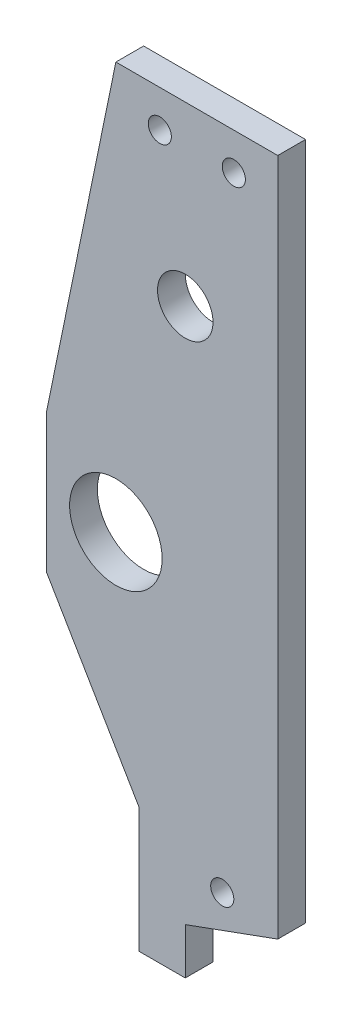
ISO-10303-21;
HEADER;
FILE_DESCRIPTION(('STEP AP214'),'2;1');
FILE_NAME('part.step','',(''),(''),'','','');
FILE_SCHEMA(('AUTOMOTIVE_DESIGN { 1 0 10303 214 1 1 1 1 }'));
ENDSEC;
DATA;
#1=APPLICATION_CONTEXT('core data for automotive mechanical design processes');
#2=APPLICATION_PROTOCOL_DEFINITION('international standard','automotive_design',2000,#1);
#3=PRODUCT_CONTEXT('',#1,'mechanical');
#4=PRODUCT('Part','Part','',(#3));
#5=PRODUCT_RELATED_PRODUCT_CATEGORY('part','',(#4));
#6=PRODUCT_DEFINITION_FORMATION('','',#4);
#7=PRODUCT_DEFINITION_CONTEXT('part definition',#1,'design');
#8=PRODUCT_DEFINITION('design','',#6,#7);
#9=PRODUCT_DEFINITION_SHAPE('','',#8);
#10=(LENGTH_UNIT() NAMED_UNIT(*) SI_UNIT(.MILLI.,.METRE.));
#11=(NAMED_UNIT(*) PLANE_ANGLE_UNIT() SI_UNIT($,.RADIAN.));
#12=(NAMED_UNIT(*) SI_UNIT($,.STERADIAN.) SOLID_ANGLE_UNIT());
#13=UNCERTAINTY_MEASURE_WITH_UNIT(LENGTH_MEASURE(1.E-05),#10,'distance_accuracy_value','');
#14=(GEOMETRIC_REPRESENTATION_CONTEXT(3) GLOBAL_UNCERTAINTY_ASSIGNED_CONTEXT((#13)) GLOBAL_UNIT_ASSIGNED_CONTEXT((#10,
#11,#12)) REPRESENTATION_CONTEXT('',''));
#15=CARTESIAN_POINT('',(0.,0.,0.));
#16=DIRECTION('',(0.,0.,1.));
#17=DIRECTION('',(1.,0.,0.));
#18=AXIS2_PLACEMENT_3D('',#15,#16,#17);
#19=CARTESIAN_POINT('',(-71.0247504159733,-1.68032445923463,0.));
#20=DIRECTION('',(-0.86193421515777,-0.507020126563394,0.));
#21=DIRECTION('',(0.507020126563394,-0.861934215157769,0.));
#22=AXIS2_PLACEMENT_3D('',#19,#20,#21);
#23=PLANE('',#22);
#24=DIRECTION('',(0.507020126563394,-0.861934215157769,0.));
#25=VECTOR('',#24,1.);
#26=CARTESIAN_POINT('',(-71.0247504159733,-1.68032445923463,0.));
#27=LINE('',#26,#25);
#28=CARTESIAN_POINT('',(-71.0247504159733,-1.68032445923463,0.));
#29=VERTEX_POINT('',#28);
#30=CARTESIAN_POINT('',(-61.0247504159733,-18.6803244592347,0.));
#31=VERTEX_POINT('',#30);
#32=EDGE_CURVE('E141',#29,#31,#27,.T.);
#33=ORIENTED_EDGE('',*,*,#32,.T.);
#34=DIRECTION('',(0.,0.,1.));
#35=VECTOR('',#34,1.);
#36=CARTESIAN_POINT('',(-61.0247504159733,-18.6803244592347,0.));
#37=LINE('',#36,#35);
#38=CARTESIAN_POINT('',(-61.0247504159733,-18.6803244592347,3.));
#39=VERTEX_POINT('',#38);
#40=EDGE_CURVE('E173',#31,#39,#37,.T.);
#41=ORIENTED_EDGE('',*,*,#40,.T.);
#42=DIRECTION('',(0.507020126563394,-0.861934215157769,0.));
#43=VECTOR('',#42,1.);
#44=CARTESIAN_POINT('',(-71.0247504159733,-1.68032445923463,3.));
#45=LINE('',#44,#43);
#46=CARTESIAN_POINT('',(-71.0247504159733,-1.68032445923463,3.));
#47=VERTEX_POINT('',#46);
#48=EDGE_CURVE('E59',#47,#39,#45,.T.);
#49=ORIENTED_EDGE('',*,*,#48,.F.);
#50=DIRECTION('',(0.,0.,1.));
#51=VECTOR('',#50,1.);
#52=CARTESIAN_POINT('',(-71.0247504159733,-1.68032445923463,0.));
#53=LINE('',#52,#51);
#54=EDGE_CURVE('E133',#29,#47,#53,.T.);
#55=ORIENTED_EDGE('',*,*,#54,.F.);
#56=EDGE_LOOP('',(#33,#41,#49,#55));
#57=FACE_BOUND('',#56,.T.);
#58=ADVANCED_FACE('F35',(#57),#23,.T.);
#59=CARTESIAN_POINT('',(-56.0247504159734,49.8196755407654,3.));
#60=DIRECTION('',(0.,-1.,0.));
#61=DIRECTION('',(0.,0.,-1.));
#62=AXIS2_PLACEMENT_3D('',#59,#60,#61);
#63=PLANE('',#62);
#64=DIRECTION('',(-1.,0.,0.));
#65=VECTOR('',#64,1.);
#66=CARTESIAN_POINT('',(-56.0247504159734,49.8196755407654,3.));
#67=LINE('',#66,#65);
#68=CARTESIAN_POINT('',(-46.0247504159733,49.8196755407654,3.));
#69=VERTEX_POINT('',#68);
#70=CARTESIAN_POINT('',(-63.5247504159734,49.8196755407654,3.));
#71=VERTEX_POINT('',#70);
#72=EDGE_CURVE('E123',#69,#71,#67,.T.);
#73=ORIENTED_EDGE('',*,*,#72,.F.);
#74=DIRECTION('',(0.,0.,1.));
#75=VECTOR('',#74,1.);
#76=CARTESIAN_POINT('',(-46.0247504159733,49.8196755407654,-5.00000000001367E-05));
#77=LINE('',#76,#75);
#78=CARTESIAN_POINT('',(-46.0247504159733,49.8196755407654,0.));
#79=VERTEX_POINT('',#78);
#80=EDGE_CURVE('E107',#79,#69,#77,.T.);
#81=ORIENTED_EDGE('',*,*,#80,.F.);
#82=DIRECTION('',(-1.,0.,0.));
#83=VECTOR('',#82,1.);
#84=CARTESIAN_POINT('',(-56.0247504159734,49.8196755407654,0.));
#85=LINE('',#84,#83);
#86=CARTESIAN_POINT('',(-63.5247504159734,49.8196755407654,0.));
#87=VERTEX_POINT('',#86);
#88=EDGE_CURVE('E130',#79,#87,#85,.T.);
#89=ORIENTED_EDGE('',*,*,#88,.T.);
#90=DIRECTION('',(0.,0.,1.));
#91=VECTOR('',#90,1.);
#92=CARTESIAN_POINT('',(-63.5247504159734,49.8196755407654,0.));
#93=LINE('',#92,#91);
#94=EDGE_CURVE('E128',#87,#71,#93,.T.);
#95=ORIENTED_EDGE('',*,*,#94,.T.);
#96=EDGE_LOOP('',(#73,#81,#89,#95));
#97=FACE_BOUND('',#96,.T.);
#98=ADVANCED_FACE('F37',(#97),#63,.F.);
#99=CARTESIAN_POINT('',(0.,0.,3.));
#100=DIRECTION('',(0.,0.,-1.));
#101=DIRECTION('',(-1.,0.,0.));
#102=AXIS2_PLACEMENT_3D('',#99,#100,#101);
#103=PLANE('',#102);
#104=CARTESIAN_POINT('',(-50.7747504159733,45.8196755407654,3.));
#105=DIRECTION('',(0.,0.,1.));
#106=DIRECTION('',(1.,0.,0.));
#107=AXIS2_PLACEMENT_3D('',#104,#105,#106);
#108=CIRCLE('',#107,1.25);
#109=CARTESIAN_POINT('',(-49.5247504159733,45.8196755407654,3.));
#110=VERTEX_POINT('',#109);
#111=EDGE_CURVE('E273',#110,#110,#108,.T.);
#112=ORIENTED_EDGE('',*,*,#111,.F.);
#113=EDGE_LOOP('',(#112));
#114=FACE_BOUND('',#113,.T.);
#115=CARTESIAN_POINT('',(-58.7747504159734,45.8196755407654,3.));
#116=DIRECTION('',(0.,0.,1.));
#117=DIRECTION('',(1.,0.,0.));
#118=AXIS2_PLACEMENT_3D('',#115,#116,#117);
#119=CIRCLE('',#118,1.25);
#120=CARTESIAN_POINT('',(-57.5247504159734,45.8196755407654,3.));
#121=VERTEX_POINT('',#120);
#122=EDGE_CURVE('E265',#121,#121,#119,.T.);
#123=ORIENTED_EDGE('',*,*,#122,.F.);
#124=EDGE_LOOP('',(#123));
#125=FACE_BOUND('',#124,.T.);
#126=CARTESIAN_POINT('',(-52.0247504159733,-22.1803244592346,3.));
#127=DIRECTION('',(0.,0.,1.));
#128=DIRECTION('',(1.,0.,0.));
#129=AXIS2_PLACEMENT_3D('',#126,#127,#128);
#130=CIRCLE('',#129,1.25);
#131=CARTESIAN_POINT('',(-50.7747504159733,-22.1803244592346,3.));
#132=VERTEX_POINT('',#131);
#133=EDGE_CURVE('E195',#132,#132,#130,.T.);
#134=ORIENTED_EDGE('',*,*,#133,.F.);
#135=EDGE_LOOP('',(#134));
#136=FACE_BOUND('',#135,.T.);
#137=CARTESIAN_POINT('',(-56.0247504159733,30.7144541097746,3.));
#138=DIRECTION('',(0.,0.,1.));
#139=DIRECTION('',(1.,0.,0.));
#140=AXIS2_PLACEMENT_3D('',#137,#138,#139);
#141=CIRCLE('',#140,3.);
#142=CARTESIAN_POINT('',(-53.0247504159733,30.7144541097746,3.));
#143=VERTEX_POINT('',#142);
#144=EDGE_CURVE('E192',#143,#143,#141,.T.);
#145=ORIENTED_EDGE('',*,*,#144,.F.);
#146=EDGE_LOOP('',(#145));
#147=FACE_BOUND('',#146,.T.);
#148=CARTESIAN_POINT('',(-63.5247504159734,5.81967554076537,3.));
#149=DIRECTION('',(0.,0.,1.));
#150=DIRECTION('',(1.,0.,0.));
#151=AXIS2_PLACEMENT_3D('',#148,#149,#150);
#152=CIRCLE('',#151,5.);
#153=CARTESIAN_POINT('',(-58.5247504159734,5.81967554076537,3.));
#154=VERTEX_POINT('',#153);
#155=EDGE_CURVE('E188',#154,#154,#152,.T.);
#156=ORIENTED_EDGE('',*,*,#155,.F.);
#157=EDGE_LOOP('',(#156));
#158=FACE_BOUND('',#157,.T.);
#159=DIRECTION('',(0.,1.,0.));
#160=VECTOR('',#159,1.);
#161=CARTESIAN_POINT('',(-56.0247504159734,-27.1803244592346,3.));
#162=LINE('',#161,#160);
#163=CARTESIAN_POINT('',(-56.0247504159733,-32.1803244592346,3.));
#164=VERTEX_POINT('',#163);
#165=CARTESIAN_POINT('',(-56.0247504159734,-27.1803244592346,3.));
#166=VERTEX_POINT('',#165);
#167=EDGE_CURVE('E182',#164,#166,#162,.T.);
#168=ORIENTED_EDGE('',*,*,#167,.T.);
#169=DIRECTION('',(-0.939692620785908,-0.342020143325669,0.));
#170=VECTOR('',#169,1.);
#171=CARTESIAN_POINT('',(-56.0247504159734,-27.1803244592346,3.));
#172=LINE('',#171,#170);
#173=CARTESIAN_POINT('',(-46.0247504159733,-23.5406221165726,3.));
#174=VERTEX_POINT('',#173);
#175=EDGE_CURVE('E118',#174,#166,#172,.T.);
#176=ORIENTED_EDGE('',*,*,#175,.F.);
#177=DIRECTION('',(0.,-1.,0.));
#178=VECTOR('',#177,1.);
#179=CARTESIAN_POINT('',(-46.0247504159733,49.8196755407654,3.));
#180=LINE('',#179,#178);
#181=EDGE_CURVE('E111',#69,#174,#180,.T.);
#182=ORIENTED_EDGE('',*,*,#181,.F.);
#183=ORIENTED_EDGE('',*,*,#72,.T.);
#184=DIRECTION('',(-0.201274298349514,-0.979534918634303,0.));
#185=VECTOR('',#184,1.);
#186=CARTESIAN_POINT('',(-71.0247504159733,13.3196755407654,3.));
#187=LINE('',#186,#185);
#188=CARTESIAN_POINT('',(-71.0247504159733,13.3196755407654,3.));
#189=VERTEX_POINT('',#188);
#190=EDGE_CURVE('E159',#71,#189,#187,.T.);
#191=ORIENTED_EDGE('',*,*,#190,.T.);
#192=DIRECTION('',(0.,-1.,0.));
#193=VECTOR('',#192,1.);
#194=CARTESIAN_POINT('',(-71.0247504159733,-1.68032445923463,3.));
#195=LINE('',#194,#193);
#196=EDGE_CURVE('E151',#189,#47,#195,.T.);
#197=ORIENTED_EDGE('',*,*,#196,.T.);
#198=ORIENTED_EDGE('',*,*,#48,.T.);
#199=DIRECTION('',(0.,-1.,0.));
#200=VECTOR('',#199,1.);
#201=CARTESIAN_POINT('',(-61.0247504159733,-32.1803244592346,3.));
#202=LINE('',#201,#200);
#203=CARTESIAN_POINT('',(-61.0247504159733,-32.1803244592346,3.));
#204=VERTEX_POINT('',#203);
#205=EDGE_CURVE('E52',#39,#204,#202,.T.);
#206=ORIENTED_EDGE('',*,*,#205,.T.);
#207=DIRECTION('',(1.,0.,0.));
#208=VECTOR('',#207,1.);
#209=CARTESIAN_POINT('',(-56.0247504159733,-32.1803244592346,3.));
#210=LINE('',#209,#208);
#211=EDGE_CURVE('E212',#204,#164,#210,.T.);
#212=ORIENTED_EDGE('',*,*,#211,.T.);
#213=EDGE_LOOP('',(#168,#176,#182,#183,#191,#197,#198,#206,#212));
#214=FACE_BOUND('',#213,.T.);
#215=ADVANCED_FACE('F122',(#114,#125,#136,#147,#158,#214),#103,.F.);
#216=CARTESIAN_POINT('',(0.,0.,0.));
#217=DIRECTION('',(0.,0.,-1.));
#218=DIRECTION('',(-1.,0.,0.));
#219=AXIS2_PLACEMENT_3D('',#216,#217,#218);
#220=PLANE('',#219);
#221=CARTESIAN_POINT('',(-50.7747504159733,45.8196755407654,0.));
#222=DIRECTION('',(0.,0.,-1.));
#223=DIRECTION('',(-1.,0.,0.));
#224=AXIS2_PLACEMENT_3D('',#221,#222,#223);
#225=CIRCLE('',#224,1.25);
#226=CARTESIAN_POINT('',(-52.0247504159734,45.8196755407654,0.));
#227=VERTEX_POINT('',#226);
#228=EDGE_CURVE('E39',#227,#227,#225,.T.);
#229=ORIENTED_EDGE('',*,*,#228,.F.);
#230=EDGE_LOOP('',(#229));
#231=FACE_BOUND('',#230,.T.);
#232=CARTESIAN_POINT('',(-58.7747504159734,45.8196755407654,0.));
#233=DIRECTION('',(0.,0.,-1.));
#234=DIRECTION('',(-1.,0.,0.));
#235=AXIS2_PLACEMENT_3D('',#232,#233,#234);
#236=CIRCLE('',#235,1.25);
#237=CARTESIAN_POINT('',(-60.0247504159734,45.8196755407654,0.));
#238=VERTEX_POINT('',#237);
#239=EDGE_CURVE('E125',#238,#238,#236,.T.);
#240=ORIENTED_EDGE('',*,*,#239,.F.);
#241=EDGE_LOOP('',(#240));
#242=FACE_BOUND('',#241,.T.);
#243=DIRECTION('',(0.939692620785908,0.342020143325669,0.));
#244=VECTOR('',#243,1.);
#245=CARTESIAN_POINT('',(2.18193705348334,-5.99482278511683,0.));
#246=LINE('',#245,#244);
#247=CARTESIAN_POINT('',(-56.0247504159734,-27.1803244592346,-2.5E-06));
#248=VERTEX_POINT('',#247);
#249=CARTESIAN_POINT('',(-46.0247504159733,-23.5406221165726,0.));
#250=VERTEX_POINT('',#249);
#251=EDGE_CURVE('E201',#248,#250,#246,.T.);
#252=ORIENTED_EDGE('',*,*,#251,.F.);
#253=DIRECTION('',(0.,1.,0.));
#254=VECTOR('',#253,1.);
#255=CARTESIAN_POINT('',(-56.0247504159734,-27.1803244592346,0.));
#256=LINE('',#255,#254);
#257=CARTESIAN_POINT('',(-56.0247504159733,-32.1803244592346,0.));
#258=VERTEX_POINT('',#257);
#259=EDGE_CURVE('E176',#258,#248,#256,.T.);
#260=ORIENTED_EDGE('',*,*,#259,.F.);
#261=DIRECTION('',(1.,0.,0.));
#262=VECTOR('',#261,1.);
#263=CARTESIAN_POINT('',(-56.0247504159733,-32.1803244592346,0.));
#264=LINE('',#263,#262);
#265=CARTESIAN_POINT('',(-61.0247504159733,-32.1803244592346,0.));
#266=VERTEX_POINT('',#265);
#267=EDGE_CURVE('E181',#266,#258,#264,.T.);
#268=ORIENTED_EDGE('',*,*,#267,.F.);
#269=DIRECTION('',(0.,-1.,0.));
#270=VECTOR('',#269,1.);
#271=CARTESIAN_POINT('',(-61.0247504159733,-32.1803244592346,0.));
#272=LINE('',#271,#270);
#273=EDGE_CURVE('E178',#31,#266,#272,.T.);
#274=ORIENTED_EDGE('',*,*,#273,.F.);
#275=ORIENTED_EDGE('',*,*,#32,.F.);
#276=DIRECTION('',(0.,-1.,0.));
#277=VECTOR('',#276,1.);
#278=CARTESIAN_POINT('',(-71.0247504159733,-1.68032445923463,0.));
#279=LINE('',#278,#277);
#280=CARTESIAN_POINT('',(-71.0247504159733,13.3196755407654,0.));
#281=VERTEX_POINT('',#280);
#282=EDGE_CURVE('E148',#281,#29,#279,.T.);
#283=ORIENTED_EDGE('',*,*,#282,.F.);
#284=DIRECTION('',(-0.201274298349514,-0.979534918634303,0.));
#285=VECTOR('',#284,1.);
#286=CARTESIAN_POINT('',(-71.0247504159733,13.3196755407654,0.));
#287=LINE('',#286,#285);
#288=EDGE_CURVE('E161',#87,#281,#287,.T.);
#289=ORIENTED_EDGE('',*,*,#288,.F.);
#290=ORIENTED_EDGE('',*,*,#88,.F.);
#291=DIRECTION('',(0.,1.,0.));
#292=VECTOR('',#291,1.);
#293=CARTESIAN_POINT('',(-46.0247504159733,0.,0.));
#294=LINE('',#293,#292);
#295=EDGE_CURVE('E11',#250,#79,#294,.T.);
#296=ORIENTED_EDGE('',*,*,#295,.F.);
#297=EDGE_LOOP('',(#252,#260,#268,#274,#275,#283,#289,#290,#296));
#298=FACE_BOUND('',#297,.T.);
#299=CARTESIAN_POINT('',(-52.0247504159733,-22.1803244592346,0.));
#300=DIRECTION('',(0.,0.,-1.));
#301=DIRECTION('',(-1.,0.,0.));
#302=AXIS2_PLACEMENT_3D('',#299,#300,#301);
#303=CIRCLE('',#302,1.25);
#304=CARTESIAN_POINT('',(-53.2747504159733,-22.1803244592346,0.));
#305=VERTEX_POINT('',#304);
#306=EDGE_CURVE('E193',#305,#305,#303,.T.);
#307=ORIENTED_EDGE('',*,*,#306,.F.);
#308=EDGE_LOOP('',(#307));
#309=FACE_BOUND('',#308,.T.);
#310=CARTESIAN_POINT('',(-56.0247504159733,30.7144541097746,0.));
#311=DIRECTION('',(0.,0.,-1.));
#312=DIRECTION('',(-1.,0.,0.));
#313=AXIS2_PLACEMENT_3D('',#310,#311,#312);
#314=CIRCLE('',#313,3.);
#315=CARTESIAN_POINT('',(-59.0247504159733,30.7144541097746,0.));
#316=VERTEX_POINT('',#315);
#317=EDGE_CURVE('E189',#316,#316,#314,.T.);
#318=ORIENTED_EDGE('',*,*,#317,.F.);
#319=EDGE_LOOP('',(#318));
#320=FACE_BOUND('',#319,.T.);
#321=CARTESIAN_POINT('',(-63.5247504159734,5.81967554076537,0.));
#322=DIRECTION('',(0.,0.,-1.));
#323=DIRECTION('',(-1.,0.,0.));
#324=AXIS2_PLACEMENT_3D('',#321,#322,#323);
#325=CIRCLE('',#324,5.);
#326=CARTESIAN_POINT('',(-68.5247504159734,5.81967554076537,0.));
#327=VERTEX_POINT('',#326);
#328=EDGE_CURVE('E185',#327,#327,#325,.T.);
#329=ORIENTED_EDGE('',*,*,#328,.F.);
#330=EDGE_LOOP('',(#329));
#331=FACE_BOUND('',#330,.T.);
#332=ADVANCED_FACE('F226',(#231,#242,#298,#309,#320,#331),#220,.T.);
#333=CARTESIAN_POINT('',(-71.0247504159733,-1.68032445923463,0.));
#334=DIRECTION('',(-1.,0.,0.));
#335=DIRECTION('',(0.,0.,1.));
#336=AXIS2_PLACEMENT_3D('',#333,#334,#335);
#337=PLANE('',#336);
#338=ORIENTED_EDGE('',*,*,#196,.F.);
#339=DIRECTION('',(0.,0.,1.));
#340=VECTOR('',#339,1.);
#341=CARTESIAN_POINT('',(-71.0247504159733,13.3196755407654,0.));
#342=LINE('',#341,#340);
#343=EDGE_CURVE('E136',#281,#189,#342,.T.);
#344=ORIENTED_EDGE('',*,*,#343,.F.);
#345=ORIENTED_EDGE('',*,*,#282,.T.);
#346=ORIENTED_EDGE('',*,*,#54,.T.);
#347=EDGE_LOOP('',(#338,#344,#345,#346));
#348=FACE_BOUND('',#347,.T.);
#349=ADVANCED_FACE('F163',(#348),#337,.T.);
#350=CARTESIAN_POINT('',(-71.0247504159733,13.3196755407654,0.));
#351=DIRECTION('',(-0.979534918634303,0.201274298349514,0.));
#352=DIRECTION('',(-0.201274298349514,-0.979534918634303,0.));
#353=AXIS2_PLACEMENT_3D('',#350,#351,#352);
#354=PLANE('',#353);
#355=ORIENTED_EDGE('',*,*,#190,.F.);
#356=ORIENTED_EDGE('',*,*,#94,.F.);
#357=ORIENTED_EDGE('',*,*,#288,.T.);
#358=ORIENTED_EDGE('',*,*,#343,.T.);
#359=EDGE_LOOP('',(#355,#356,#357,#358));
#360=FACE_BOUND('',#359,.T.);
#361=ADVANCED_FACE('F158',(#360),#354,.T.);
#362=CARTESIAN_POINT('',(-56.0247504159734,-27.1803244592346,0.));
#363=DIRECTION('',(1.,0.,0.));
#364=DIRECTION('',(0.,1.,0.));
#365=AXIS2_PLACEMENT_3D('',#362,#363,#364);
#366=PLANE('',#365);
#367=ORIENTED_EDGE('',*,*,#167,.F.);
#368=DIRECTION('',(0.,0.,1.));
#369=VECTOR('',#368,1.);
#370=CARTESIAN_POINT('',(-56.0247504159733,-32.1803244592346,0.));
#371=LINE('',#370,#369);
#372=EDGE_CURVE('E164',#258,#164,#371,.T.);
#373=ORIENTED_EDGE('',*,*,#372,.F.);
#374=ORIENTED_EDGE('',*,*,#259,.T.);
#375=DIRECTION('',(0.,0.,-1.));
#376=VECTOR('',#375,1.);
#377=CARTESIAN_POINT('',(-56.0247504159734,-27.1803244592346,3.));
#378=LINE('',#377,#376);
#379=EDGE_CURVE('E44',#166,#248,#378,.T.);
#380=ORIENTED_EDGE('',*,*,#379,.F.);
#381=EDGE_LOOP('',(#367,#373,#374,#380));
#382=FACE_BOUND('',#381,.T.);
#383=ADVANCED_FACE('F219',(#382),#366,.T.);
#384=CARTESIAN_POINT('',(-56.0247504159733,-32.1803244592346,0.));
#385=DIRECTION('',(0.,-1.,0.));
#386=DIRECTION('',(0.,0.,-1.));
#387=AXIS2_PLACEMENT_3D('',#384,#385,#386);
#388=PLANE('',#387);
#389=ORIENTED_EDGE('',*,*,#211,.F.);
#390=DIRECTION('',(0.,0.,1.));
#391=VECTOR('',#390,1.);
#392=CARTESIAN_POINT('',(-61.0247504159733,-32.1803244592346,0.));
#393=LINE('',#392,#391);
#394=EDGE_CURVE('E167',#266,#204,#393,.T.);
#395=ORIENTED_EDGE('',*,*,#394,.F.);
#396=ORIENTED_EDGE('',*,*,#267,.T.);
#397=ORIENTED_EDGE('',*,*,#372,.T.);
#398=EDGE_LOOP('',(#389,#395,#396,#397));
#399=FACE_BOUND('',#398,.T.);
#400=ADVANCED_FACE('F234',(#399),#388,.T.);
#401=CARTESIAN_POINT('',(-61.0247504159733,-32.1803244592346,0.));
#402=DIRECTION('',(-1.,0.,0.));
#403=DIRECTION('',(0.,0.,1.));
#404=AXIS2_PLACEMENT_3D('',#401,#402,#403);
#405=PLANE('',#404);
#406=ORIENTED_EDGE('',*,*,#205,.F.);
#407=ORIENTED_EDGE('',*,*,#40,.F.);
#408=ORIENTED_EDGE('',*,*,#273,.T.);
#409=ORIENTED_EDGE('',*,*,#394,.T.);
#410=EDGE_LOOP('',(#406,#407,#408,#409));
#411=FACE_BOUND('',#410,.T.);
#412=ADVANCED_FACE('F232',(#411),#405,.T.);
#413=CARTESIAN_POINT('',(-63.5247504159734,5.81967554076537,-5.00000000001367E-05));
#414=DIRECTION('',(0.,0.,1.));
#415=DIRECTION('',(1.,0.,0.));
#416=AXIS2_PLACEMENT_3D('',#413,#414,#415);
#417=CYLINDRICAL_SURFACE('',#416,5.);
#418=ORIENTED_EDGE('',*,*,#328,.T.);
#419=EDGE_LOOP('',(#418));
#420=FACE_BOUND('',#419,.T.);
#421=ORIENTED_EDGE('',*,*,#155,.T.);
#422=EDGE_LOOP('',(#421));
#423=FACE_BOUND('',#422,.T.);
#424=ADVANCED_FACE('F241',(#420,#423),#417,.F.);
#425=CARTESIAN_POINT('',(-56.0247504159733,30.7144541097746,-5.00000000001367E-05));
#426=DIRECTION('',(0.,0.,1.));
#427=DIRECTION('',(1.,0.,0.));
#428=AXIS2_PLACEMENT_3D('',#425,#426,#427);
#429=CYLINDRICAL_SURFACE('',#428,3.);
#430=ORIENTED_EDGE('',*,*,#317,.T.);
#431=EDGE_LOOP('',(#430));
#432=FACE_BOUND('',#431,.T.);
#433=ORIENTED_EDGE('',*,*,#144,.T.);
#434=EDGE_LOOP('',(#433));
#435=FACE_BOUND('',#434,.T.);
#436=ADVANCED_FACE('F289',(#432,#435),#429,.F.);
#437=CARTESIAN_POINT('',(-52.0247504159733,-22.1803244592346,-5.00000000001367E-05));
#438=DIRECTION('',(0.,0.,1.));
#439=DIRECTION('',(1.,0.,0.));
#440=AXIS2_PLACEMENT_3D('',#437,#438,#439);
#441=CYLINDRICAL_SURFACE('',#440,1.25);
#442=ORIENTED_EDGE('',*,*,#306,.T.);
#443=EDGE_LOOP('',(#442));
#444=FACE_BOUND('',#443,.T.);
#445=ORIENTED_EDGE('',*,*,#133,.T.);
#446=EDGE_LOOP('',(#445));
#447=FACE_BOUND('',#446,.T.);
#448=ADVANCED_FACE('F295',(#444,#447),#441,.F.);
#449=CARTESIAN_POINT('',(-56.0247504159734,-27.1803244592346,-5.00000000001367E-05));
#450=DIRECTION('',(-0.342020143325669,0.939692620785908,0.));
#451=DIRECTION('',(-0.939692620785908,-0.342020143325669,0.));
#452=AXIS2_PLACEMENT_3D('',#449,#450,#451);
#453=PLANE('',#452);
#454=ORIENTED_EDGE('',*,*,#251,.T.);
#455=DIRECTION('',(0.,0.,1.));
#456=VECTOR('',#455,1.);
#457=CARTESIAN_POINT('',(-46.0247504159733,-23.5406221165726,-5.00000000001367E-05));
#458=LINE('',#457,#456);
#459=EDGE_CURVE('E117',#250,#174,#458,.T.);
#460=ORIENTED_EDGE('',*,*,#459,.T.);
#461=ORIENTED_EDGE('',*,*,#175,.T.);
#462=ORIENTED_EDGE('',*,*,#379,.T.);
#463=EDGE_LOOP('',(#454,#460,#461,#462));
#464=FACE_BOUND('',#463,.T.);
#465=ADVANCED_FACE('F224',(#464),#453,.F.);
#466=CARTESIAN_POINT('',(-46.0247504159733,49.8196755407654,-5.00000000001367E-05));
#467=DIRECTION('',(-1.,0.,0.));
#468=DIRECTION('',(0.,-1.,0.));
#469=AXIS2_PLACEMENT_3D('',#466,#467,#468);
#470=PLANE('',#469);
#471=ORIENTED_EDGE('',*,*,#295,.T.);
#472=ORIENTED_EDGE('',*,*,#80,.T.);
#473=ORIENTED_EDGE('',*,*,#181,.T.);
#474=ORIENTED_EDGE('',*,*,#459,.F.);
#475=EDGE_LOOP('',(#471,#472,#473,#474));
#476=FACE_BOUND('',#475,.T.);
#477=ADVANCED_FACE('F109',(#476),#470,.F.);
#478=CARTESIAN_POINT('',(-58.7747504159734,45.8196755407654,-7.));
#479=DIRECTION('',(0.,0.,1.));
#480=DIRECTION('',(1.,0.,0.));
#481=AXIS2_PLACEMENT_3D('',#478,#479,#480);
#482=CYLINDRICAL_SURFACE('',#481,1.25);
#483=ORIENTED_EDGE('',*,*,#239,.T.);
#484=EDGE_LOOP('',(#483));
#485=FACE_BOUND('',#484,.T.);
#486=ORIENTED_EDGE('',*,*,#122,.T.);
#487=EDGE_LOOP('',(#486));
#488=FACE_BOUND('',#487,.T.);
#489=ADVANCED_FACE('F304',(#485,#488),#482,.F.);
#490=CARTESIAN_POINT('',(-50.7747504159733,45.8196755407654,-7.));
#491=DIRECTION('',(0.,0.,1.));
#492=DIRECTION('',(1.,0.,0.));
#493=AXIS2_PLACEMENT_3D('',#490,#491,#492);
#494=CYLINDRICAL_SURFACE('',#493,1.25);
#495=ORIENTED_EDGE('',*,*,#228,.T.);
#496=EDGE_LOOP('',(#495));
#497=FACE_BOUND('',#496,.T.);
#498=ORIENTED_EDGE('',*,*,#111,.T.);
#499=EDGE_LOOP('',(#498));
#500=FACE_BOUND('',#499,.T.);
#501=ADVANCED_FACE('F279',(#497,#500),#494,.F.);
#502=CLOSED_SHELL('',(#58,#98,#215,#332,#349,#361,#383,#400,#412,#424,#436,#448,#465,#477,#489,#501));
#503=MANIFOLD_SOLID_BREP('B2',#502);
#504=ADVANCED_BREP_SHAPE_REPRESENTATION('',(#18,#503),#14);
#505=SHAPE_DEFINITION_REPRESENTATION(#9,#504);
ENDSEC;
END-ISO-10303-21;
